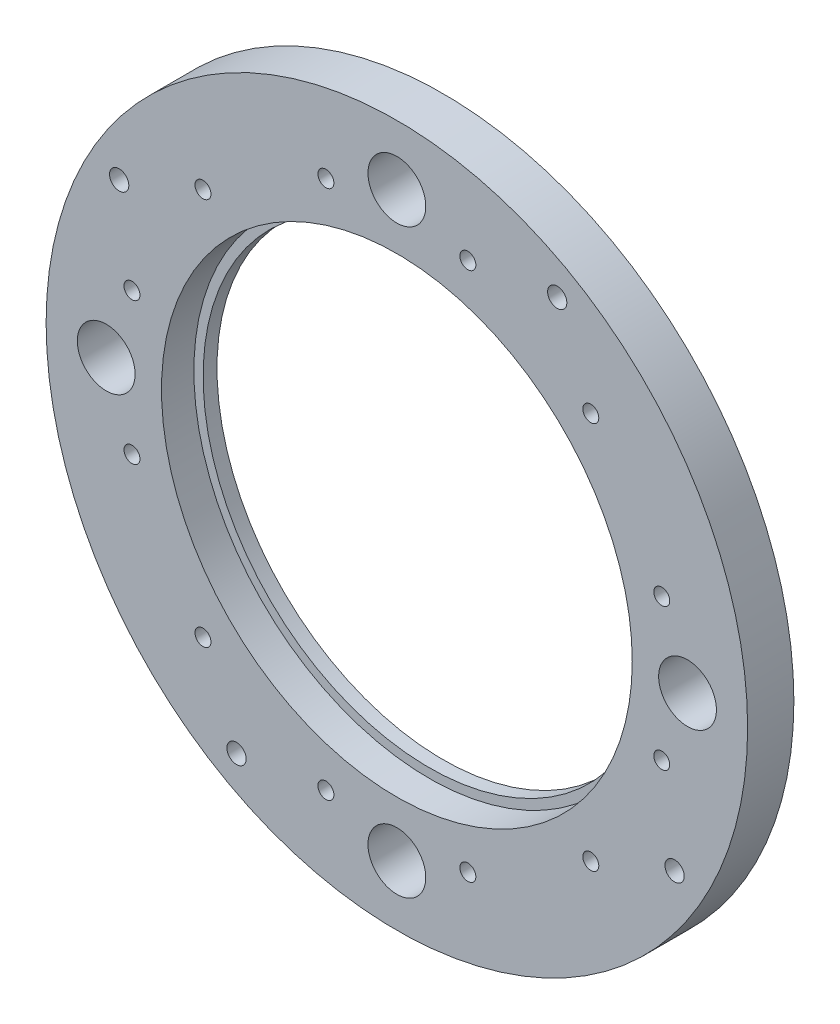
ISO-10303-21;
HEADER;
FILE_DESCRIPTION(('STEP AP214'),'2;1');
FILE_NAME('part.step','',(''),(''),'','','');
FILE_SCHEMA(('AUTOMOTIVE_DESIGN { 1 0 10303 214 1 1 1 1 }'));
ENDSEC;
DATA;
#1=APPLICATION_CONTEXT('core data for automotive mechanical design processes');
#2=APPLICATION_PROTOCOL_DEFINITION('international standard','automotive_design',2000,#1);
#3=PRODUCT_CONTEXT('',#1,'mechanical');
#4=PRODUCT('Part','Part','',(#3));
#5=PRODUCT_RELATED_PRODUCT_CATEGORY('part','',(#4));
#6=PRODUCT_DEFINITION_FORMATION('','',#4);
#7=PRODUCT_DEFINITION_CONTEXT('part definition',#1,'design');
#8=PRODUCT_DEFINITION('design','',#6,#7);
#9=PRODUCT_DEFINITION_SHAPE('','',#8);
#10=(LENGTH_UNIT() NAMED_UNIT(*) SI_UNIT(.MILLI.,.METRE.));
#11=(NAMED_UNIT(*) PLANE_ANGLE_UNIT() SI_UNIT($,.RADIAN.));
#12=(NAMED_UNIT(*) SI_UNIT($,.STERADIAN.) SOLID_ANGLE_UNIT());
#13=UNCERTAINTY_MEASURE_WITH_UNIT(LENGTH_MEASURE(1.E-05),#10,'distance_accuracy_value','');
#14=(GEOMETRIC_REPRESENTATION_CONTEXT(3) GLOBAL_UNCERTAINTY_ASSIGNED_CONTEXT((#13)) GLOBAL_UNIT_ASSIGNED_CONTEXT((#10,
#11,#12)) REPRESENTATION_CONTEXT('',''));
#15=CARTESIAN_POINT('',(0.,0.,0.));
#16=DIRECTION('',(0.,0.,1.));
#17=DIRECTION('',(1.,0.,0.));
#18=AXIS2_PLACEMENT_3D('',#15,#16,#17);
#19=CARTESIAN_POINT('',(0.,0.,5.));
#20=DIRECTION('',(0.,0.,-1.));
#21=DIRECTION('',(-1.,0.,0.));
#22=AXIS2_PLACEMENT_3D('',#19,#20,#21);
#23=CYLINDRICAL_SURFACE('',#22,75.85);
#24=CARTESIAN_POINT('',(0.,0.,5.));
#25=DIRECTION('',(0.,0.,-1.));
#26=DIRECTION('',(-1.,0.,0.));
#27=AXIS2_PLACEMENT_3D('',#24,#25,#26);
#28=CIRCLE('',#27,75.85);
#29=CARTESIAN_POINT('',(-75.85,0.,5.));
#30=VERTEX_POINT('',#29);
#31=EDGE_CURVE('E10',#30,#30,#28,.T.);
#32=ORIENTED_EDGE('',*,*,#31,.T.);
#33=EDGE_LOOP('',(#32));
#34=FACE_BOUND('',#33,.T.);
#35=CARTESIAN_POINT('',(0.,0.,-5.));
#36=DIRECTION('',(0.,0.,-1.));
#37=DIRECTION('',(-1.,0.,0.));
#38=AXIS2_PLACEMENT_3D('',#35,#36,#37);
#39=CIRCLE('',#38,75.85);
#40=CARTESIAN_POINT('',(-75.85,0.,-5.));
#41=VERTEX_POINT('',#40);
#42=EDGE_CURVE('E48',#41,#41,#39,.T.);
#43=ORIENTED_EDGE('',*,*,#42,.F.);
#44=EDGE_LOOP('',(#43));
#45=FACE_BOUND('',#44,.T.);
#46=ADVANCED_FACE('F41',(#34,#45),#23,.T.);
#47=CARTESIAN_POINT('',(75.85,0.,5.));
#48=DIRECTION('',(0.,0.,1.));
#49=DIRECTION('',(1.,0.,0.));
#50=AXIS2_PLACEMENT_3D('',#47,#48,#49);
#51=PLANE('',#50);
#52=CARTESIAN_POINT('',(0.,0.,5.));
#53=DIRECTION('',(0.,0.,1.));
#54=DIRECTION('',(1.,0.,0.));
#55=AXIS2_PLACEMENT_3D('',#52,#53,#54);
#56=CIRCLE('',#55,50.9);
#57=CARTESIAN_POINT('',(50.9,0.,5.));
#58=VERTEX_POINT('',#57);
#59=EDGE_CURVE('E230',#58,#58,#56,.T.);
#60=ORIENTED_EDGE('',*,*,#59,.F.);
#61=EDGE_LOOP('',(#60));
#62=FACE_BOUND('',#61,.T.);
#63=CARTESIAN_POINT('',(-62.85,0.,4.99999999999999));
#64=DIRECTION('',(0.,0.,-1.));
#65=DIRECTION('',(-1.,0.,0.));
#66=AXIS2_PLACEMENT_3D('',#63,#64,#65);
#67=CIRCLE('',#66,6.24999999999998);
#68=CARTESIAN_POINT('',(-69.1,0.,4.99999999999999));
#69=VERTEX_POINT('',#68);
#70=EDGE_CURVE('E210',#69,#69,#67,.T.);
#71=ORIENTED_EDGE('',*,*,#70,.T.);
#72=EDGE_LOOP('',(#71));
#73=FACE_BOUND('',#72,.T.);
#74=CARTESIAN_POINT('',(0.,-62.85,4.99999999999999));
#75=DIRECTION('',(0.,0.,-1.));
#76=DIRECTION('',(-1.,0.,0.));
#77=AXIS2_PLACEMENT_3D('',#74,#75,#76);
#78=CIRCLE('',#77,6.24999999999999);
#79=CARTESIAN_POINT('',(-6.24999999999997,-62.85,4.99999999999999));
#80=VERTEX_POINT('',#79);
#81=EDGE_CURVE('E202',#80,#80,#78,.T.);
#82=ORIENTED_EDGE('',*,*,#81,.T.);
#83=EDGE_LOOP('',(#82));
#84=FACE_BOUND('',#83,.T.);
#85=CARTESIAN_POINT('',(62.85,0.,4.99999999999999));
#86=DIRECTION('',(0.,0.,-1.));
#87=DIRECTION('',(-1.,0.,0.));
#88=AXIS2_PLACEMENT_3D('',#85,#86,#87);
#89=CIRCLE('',#88,6.24999999999999);
#90=CARTESIAN_POINT('',(56.6,0.,4.99999999999999));
#91=VERTEX_POINT('',#90);
#92=EDGE_CURVE('E194',#91,#91,#89,.T.);
#93=ORIENTED_EDGE('',*,*,#92,.T.);
#94=EDGE_LOOP('',(#93));
#95=FACE_BOUND('',#94,.T.);
#96=CARTESIAN_POINT('',(0.,62.85,4.99999999999999));
#97=DIRECTION('',(0.,0.,-1.));
#98=DIRECTION('',(-1.,0.,0.));
#99=AXIS2_PLACEMENT_3D('',#96,#97,#98);
#100=CIRCLE('',#99,6.24999999999999);
#101=CARTESIAN_POINT('',(-6.24999999999998,62.85,4.99999999999999));
#102=VERTEX_POINT('',#101);
#103=EDGE_CURVE('E186',#102,#102,#100,.T.);
#104=ORIENTED_EDGE('',*,*,#103,.T.);
#105=EDGE_LOOP('',(#104));
#106=FACE_BOUND('',#105,.T.);
#107=CARTESIAN_POINT('',(-41.9314321243622,41.9314321243622,4.99999999999999));
#108=DIRECTION('',(0.,0.,-1.));
#109=DIRECTION('',(-1.,0.,0.));
#110=AXIS2_PLACEMENT_3D('',#107,#108,#109);
#111=CIRCLE('',#110,1.72719999999998);
#112=CARTESIAN_POINT('',(-43.6586321243622,41.9314321243622,4.99999999999999));
#113=VERTEX_POINT('',#112);
#114=EDGE_CURVE('E178',#113,#113,#111,.T.);
#115=ORIENTED_EDGE('',*,*,#114,.T.);
#116=EDGE_LOOP('',(#115));
#117=FACE_BOUND('',#116,.T.);
#118=CARTESIAN_POINT('',(-57.2794014989404,15.3479693745799,4.99999999999999));
#119=DIRECTION('',(0.,0.,-1.));
#120=DIRECTION('',(-1.,0.,0.));
#121=AXIS2_PLACEMENT_3D('',#118,#119,#120);
#122=CIRCLE('',#121,1.72719999999998);
#123=CARTESIAN_POINT('',(-59.0066014989404,15.3479693745799,4.99999999999999));
#124=VERTEX_POINT('',#123);
#125=EDGE_CURVE('E170',#124,#124,#122,.T.);
#126=ORIENTED_EDGE('',*,*,#125,.T.);
#127=EDGE_LOOP('',(#126));
#128=FACE_BOUND('',#127,.T.);
#129=CARTESIAN_POINT('',(-57.2794014989394,-15.3479693745781,4.99999999999999));
#130=DIRECTION('',(0.,0.,-1.));
#131=DIRECTION('',(-1.,0.,0.));
#132=AXIS2_PLACEMENT_3D('',#129,#130,#131);
#133=CIRCLE('',#132,1.72719999999998);
#134=CARTESIAN_POINT('',(-59.0066014989394,-15.3479693745781,4.99999999999999));
#135=VERTEX_POINT('',#134);
#136=EDGE_CURVE('E162',#135,#135,#133,.T.);
#137=ORIENTED_EDGE('',*,*,#136,.T.);
#138=EDGE_LOOP('',(#137));
#139=FACE_BOUND('',#138,.T.);
#140=CARTESIAN_POINT('',(-41.9314321243595,-41.9314321243595,4.99999999999999));
#141=DIRECTION('',(0.,0.,-1.));
#142=DIRECTION('',(-1.,0.,0.));
#143=AXIS2_PLACEMENT_3D('',#140,#141,#142);
#144=CIRCLE('',#143,1.72719999999998);
#145=CARTESIAN_POINT('',(-43.6586321243595,-41.9314321243595,4.99999999999999));
#146=VERTEX_POINT('',#145);
#147=EDGE_CURVE('E154',#146,#146,#144,.T.);
#148=ORIENTED_EDGE('',*,*,#147,.T.);
#149=EDGE_LOOP('',(#148));
#150=FACE_BOUND('',#149,.T.);
#151=CARTESIAN_POINT('',(-15.3479693745772,-57.2794014989375,4.99999999999999));
#152=DIRECTION('',(0.,0.,-1.));
#153=DIRECTION('',(-1.,0.,0.));
#154=AXIS2_PLACEMENT_3D('',#151,#152,#153);
#155=CIRCLE('',#154,1.72719999999998);
#156=CARTESIAN_POINT('',(-17.0751693745772,-57.2794014989375,4.99999999999999));
#157=VERTEX_POINT('',#156);
#158=EDGE_CURVE('E146',#157,#157,#155,.T.);
#159=ORIENTED_EDGE('',*,*,#158,.T.);
#160=EDGE_LOOP('',(#159));
#161=FACE_BOUND('',#160,.T.);
#162=CARTESIAN_POINT('',(15.3479693745807,-57.2794014989365,4.99999999999999));
#163=DIRECTION('',(0.,0.,-1.));
#164=DIRECTION('',(-1.,0.,0.));
#165=AXIS2_PLACEMENT_3D('',#162,#163,#164);
#166=CIRCLE('',#165,1.72719999999999);
#167=CARTESIAN_POINT('',(13.6207693745808,-57.2794014989365,4.99999999999999));
#168=VERTEX_POINT('',#167);
#169=EDGE_CURVE('E138',#168,#168,#166,.T.);
#170=ORIENTED_EDGE('',*,*,#169,.T.);
#171=EDGE_LOOP('',(#170));
#172=FACE_BOUND('',#171,.T.);
#173=CARTESIAN_POINT('',(41.9314321243622,-41.9314321243567,4.99999999999999));
#174=DIRECTION('',(0.,0.,-1.));
#175=DIRECTION('',(-1.,0.,0.));
#176=AXIS2_PLACEMENT_3D('',#173,#174,#175);
#177=CIRCLE('',#176,1.72719999999998);
#178=CARTESIAN_POINT('',(40.2042321243622,-41.9314321243567,4.99999999999999));
#179=VERTEX_POINT('',#178);
#180=EDGE_CURVE('E130',#179,#179,#177,.T.);
#181=ORIENTED_EDGE('',*,*,#180,.T.);
#182=EDGE_LOOP('',(#181));
#183=FACE_BOUND('',#182,.T.);
#184=CARTESIAN_POINT('',(57.2794014989402,-15.3479693745744,4.99999999999999));
#185=DIRECTION('',(0.,0.,-1.));
#186=DIRECTION('',(-1.,0.,0.));
#187=AXIS2_PLACEMENT_3D('',#184,#185,#186);
#188=CIRCLE('',#187,1.72719999999998);
#189=CARTESIAN_POINT('',(55.5522014989402,-15.3479693745744,4.99999999999999));
#190=VERTEX_POINT('',#189);
#191=EDGE_CURVE('E122',#190,#190,#188,.T.);
#192=ORIENTED_EDGE('',*,*,#191,.T.);
#193=EDGE_LOOP('',(#192));
#194=FACE_BOUND('',#193,.T.);
#195=CARTESIAN_POINT('',(57.2794014989393,15.3479693745836,4.99999999999999));
#196=DIRECTION('',(0.,0.,-1.));
#197=DIRECTION('',(-1.,0.,0.));
#198=AXIS2_PLACEMENT_3D('',#195,#196,#197);
#199=CIRCLE('',#198,1.72719999999998);
#200=CARTESIAN_POINT('',(55.5522014989393,15.3479693745836,4.99999999999999));
#201=VERTEX_POINT('',#200);
#202=EDGE_CURVE('E114',#201,#201,#199,.T.);
#203=ORIENTED_EDGE('',*,*,#202,.T.);
#204=EDGE_LOOP('',(#203));
#205=FACE_BOUND('',#204,.T.);
#206=CARTESIAN_POINT('',(41.9314321243595,41.931432124365,4.99999999999999));
#207=DIRECTION('',(0.,0.,-1.));
#208=DIRECTION('',(-1.,0.,0.));
#209=AXIS2_PLACEMENT_3D('',#206,#207,#208);
#210=CIRCLE('',#209,1.72719999999998);
#211=CARTESIAN_POINT('',(40.2042321243595,41.931432124365,4.99999999999999));
#212=VERTEX_POINT('',#211);
#213=EDGE_CURVE('E106',#212,#212,#210,.T.);
#214=ORIENTED_EDGE('',*,*,#213,.T.);
#215=EDGE_LOOP('',(#214));
#216=FACE_BOUND('',#215,.T.);
#217=CARTESIAN_POINT('',(15.3479693745771,57.2794014989431,4.99999999999999));
#218=DIRECTION('',(0.,0.,-1.));
#219=DIRECTION('',(-1.,0.,0.));
#220=AXIS2_PLACEMENT_3D('',#217,#218,#219);
#221=CIRCLE('',#220,1.72719999999999);
#222=CARTESIAN_POINT('',(13.6207693745771,57.2794014989431,4.99999999999999));
#223=VERTEX_POINT('',#222);
#224=EDGE_CURVE('E98',#223,#223,#221,.T.);
#225=ORIENTED_EDGE('',*,*,#224,.T.);
#226=EDGE_LOOP('',(#225));
#227=FACE_BOUND('',#226,.T.);
#228=CARTESIAN_POINT('',(-15.3479693745809,57.2794014989421,4.99999999999999));
#229=DIRECTION('',(0.,0.,-1.));
#230=DIRECTION('',(-1.,0.,0.));
#231=AXIS2_PLACEMENT_3D('',#228,#229,#230);
#232=CIRCLE('',#231,1.72719999999998);
#233=CARTESIAN_POINT('',(-17.0751693745809,57.2794014989421,4.99999999999999));
#234=VERTEX_POINT('',#233);
#235=EDGE_CURVE('E90',#234,#234,#232,.T.);
#236=ORIENTED_EDGE('',*,*,#235,.T.);
#237=EDGE_LOOP('',(#236));
#238=FACE_BOUND('',#237,.T.);
#239=CARTESIAN_POINT('',(-60.0519335492206,34.671,4.99999999999999));
#240=DIRECTION('',(0.,0.,-1.));
#241=DIRECTION('',(-1.,0.,0.));
#242=AXIS2_PLACEMENT_3D('',#239,#240,#241);
#243=CIRCLE('',#242,2.08279999999999);
#244=CARTESIAN_POINT('',(-62.1347335492206,34.671,4.99999999999999));
#245=VERTEX_POINT('',#244);
#246=EDGE_CURVE('E82',#245,#245,#243,.T.);
#247=ORIENTED_EDGE('',*,*,#246,.T.);
#248=EDGE_LOOP('',(#247));
#249=FACE_BOUND('',#248,.T.);
#250=CARTESIAN_POINT('',(34.671,60.0519335492206,4.99999999999999));
#251=DIRECTION('',(0.,0.,-1.));
#252=DIRECTION('',(-1.,0.,0.));
#253=AXIS2_PLACEMENT_3D('',#250,#251,#252);
#254=CIRCLE('',#253,2.08279999999999);
#255=CARTESIAN_POINT('',(32.5882,60.0519335492206,4.99999999999999));
#256=VERTEX_POINT('',#255);
#257=EDGE_CURVE('E74',#256,#256,#254,.T.);
#258=ORIENTED_EDGE('',*,*,#257,.T.);
#259=EDGE_LOOP('',(#258));
#260=FACE_BOUND('',#259,.T.);
#261=CARTESIAN_POINT('',(60.0519335492206,-34.671,4.99999999999999));
#262=DIRECTION('',(0.,0.,-1.));
#263=DIRECTION('',(-1.,0.,0.));
#264=AXIS2_PLACEMENT_3D('',#261,#262,#263);
#265=CIRCLE('',#264,2.08279999999999);
#266=CARTESIAN_POINT('',(57.9691335492206,-34.671,4.99999999999999));
#267=VERTEX_POINT('',#266);
#268=EDGE_CURVE('E66',#267,#267,#265,.T.);
#269=ORIENTED_EDGE('',*,*,#268,.T.);
#270=EDGE_LOOP('',(#269));
#271=FACE_BOUND('',#270,.T.);
#272=CARTESIAN_POINT('',(-34.671,-60.0519335492206,4.99999999999999));
#273=DIRECTION('',(0.,0.,-1.));
#274=DIRECTION('',(-1.,0.,0.));
#275=AXIS2_PLACEMENT_3D('',#272,#273,#274);
#276=CIRCLE('',#275,2.08279999999999);
#277=CARTESIAN_POINT('',(-36.7538,-60.0519335492206,4.99999999999999));
#278=VERTEX_POINT('',#277);
#279=EDGE_CURVE('E54',#278,#278,#276,.T.);
#280=ORIENTED_EDGE('',*,*,#279,.T.);
#281=EDGE_LOOP('',(#280));
#282=FACE_BOUND('',#281,.T.);
#283=ORIENTED_EDGE('',*,*,#31,.F.);
#284=EDGE_LOOP('',(#283));
#285=FACE_BOUND('',#284,.T.);
#286=ADVANCED_FACE('F238',(#62,#73,#84,#95,#106,#117,#128,#139,#150,#161,#172,#183,#194,#205,
#216,#227,#238,#249,#260,#271,#282,#285),#51,.T.);
#287=CARTESIAN_POINT('',(0.,0.,-5.));
#288=DIRECTION('',(0.,0.,-1.));
#289=DIRECTION('',(-1.,0.,0.));
#290=AXIS2_PLACEMENT_3D('',#287,#288,#289);
#291=PLANE('',#290);
#292=CARTESIAN_POINT('',(0.,0.,-5.00000000000001));
#293=DIRECTION('',(0.,0.,1.));
#294=DIRECTION('',(1.,0.,0.));
#295=AXIS2_PLACEMENT_3D('',#292,#293,#294);
#296=CIRCLE('',#295,48.9);
#297=CARTESIAN_POINT('',(48.9,0.,-5.00000000000001));
#298=VERTEX_POINT('',#297);
#299=EDGE_CURVE('E218',#298,#298,#296,.T.);
#300=ORIENTED_EDGE('',*,*,#299,.T.);
#301=EDGE_LOOP('',(#300));
#302=FACE_BOUND('',#301,.T.);
#303=CARTESIAN_POINT('',(-62.85,0.,-5.));
#304=DIRECTION('',(0.,0.,-1.));
#305=DIRECTION('',(-1.,0.,0.));
#306=AXIS2_PLACEMENT_3D('',#303,#304,#305);
#307=CIRCLE('',#306,6.24999999999998);
#308=CARTESIAN_POINT('',(-69.1,0.,-5.));
#309=VERTEX_POINT('',#308);
#310=EDGE_CURVE('E214',#309,#309,#307,.T.);
#311=ORIENTED_EDGE('',*,*,#310,.F.);
#312=EDGE_LOOP('',(#311));
#313=FACE_BOUND('',#312,.T.);
#314=CARTESIAN_POINT('',(0.,-62.85,-5.));
#315=DIRECTION('',(0.,0.,-1.));
#316=DIRECTION('',(-1.,0.,0.));
#317=AXIS2_PLACEMENT_3D('',#314,#315,#316);
#318=CIRCLE('',#317,6.24999999999999);
#319=CARTESIAN_POINT('',(-6.24999999999997,-62.85,-5.));
#320=VERTEX_POINT('',#319);
#321=EDGE_CURVE('E206',#320,#320,#318,.T.);
#322=ORIENTED_EDGE('',*,*,#321,.F.);
#323=EDGE_LOOP('',(#322));
#324=FACE_BOUND('',#323,.T.);
#325=CARTESIAN_POINT('',(62.85,0.,-5.));
#326=DIRECTION('',(0.,0.,-1.));
#327=DIRECTION('',(-1.,0.,0.));
#328=AXIS2_PLACEMENT_3D('',#325,#326,#327);
#329=CIRCLE('',#328,6.24999999999999);
#330=CARTESIAN_POINT('',(56.6,0.,-5.));
#331=VERTEX_POINT('',#330);
#332=EDGE_CURVE('E198',#331,#331,#329,.T.);
#333=ORIENTED_EDGE('',*,*,#332,.F.);
#334=EDGE_LOOP('',(#333));
#335=FACE_BOUND('',#334,.T.);
#336=CARTESIAN_POINT('',(0.,62.85,-5.));
#337=DIRECTION('',(0.,0.,-1.));
#338=DIRECTION('',(-1.,0.,0.));
#339=AXIS2_PLACEMENT_3D('',#336,#337,#338);
#340=CIRCLE('',#339,6.24999999999999);
#341=CARTESIAN_POINT('',(-6.24999999999998,62.85,-5.));
#342=VERTEX_POINT('',#341);
#343=EDGE_CURVE('E190',#342,#342,#340,.T.);
#344=ORIENTED_EDGE('',*,*,#343,.F.);
#345=EDGE_LOOP('',(#344));
#346=FACE_BOUND('',#345,.T.);
#347=CARTESIAN_POINT('',(-41.9314321243622,41.9314321243622,-5.));
#348=DIRECTION('',(0.,0.,-1.));
#349=DIRECTION('',(-1.,0.,0.));
#350=AXIS2_PLACEMENT_3D('',#347,#348,#349);
#351=CIRCLE('',#350,1.72719999999998);
#352=CARTESIAN_POINT('',(-43.6586321243622,41.9314321243622,-5.));
#353=VERTEX_POINT('',#352);
#354=EDGE_CURVE('E182',#353,#353,#351,.T.);
#355=ORIENTED_EDGE('',*,*,#354,.F.);
#356=EDGE_LOOP('',(#355));
#357=FACE_BOUND('',#356,.T.);
#358=CARTESIAN_POINT('',(-57.2794014989404,15.3479693745799,-5.));
#359=DIRECTION('',(0.,0.,-1.));
#360=DIRECTION('',(-1.,0.,0.));
#361=AXIS2_PLACEMENT_3D('',#358,#359,#360);
#362=CIRCLE('',#361,1.72719999999998);
#363=CARTESIAN_POINT('',(-59.0066014989404,15.3479693745799,-5.));
#364=VERTEX_POINT('',#363);
#365=EDGE_CURVE('E174',#364,#364,#362,.T.);
#366=ORIENTED_EDGE('',*,*,#365,.F.);
#367=EDGE_LOOP('',(#366));
#368=FACE_BOUND('',#367,.T.);
#369=CARTESIAN_POINT('',(-57.2794014989394,-15.3479693745781,-5.));
#370=DIRECTION('',(0.,0.,-1.));
#371=DIRECTION('',(-1.,0.,0.));
#372=AXIS2_PLACEMENT_3D('',#369,#370,#371);
#373=CIRCLE('',#372,1.72719999999998);
#374=CARTESIAN_POINT('',(-59.0066014989394,-15.3479693745781,-5.));
#375=VERTEX_POINT('',#374);
#376=EDGE_CURVE('E166',#375,#375,#373,.T.);
#377=ORIENTED_EDGE('',*,*,#376,.F.);
#378=EDGE_LOOP('',(#377));
#379=FACE_BOUND('',#378,.T.);
#380=CARTESIAN_POINT('',(-41.9314321243595,-41.9314321243595,-5.));
#381=DIRECTION('',(0.,0.,-1.));
#382=DIRECTION('',(-1.,0.,0.));
#383=AXIS2_PLACEMENT_3D('',#380,#381,#382);
#384=CIRCLE('',#383,1.72719999999998);
#385=CARTESIAN_POINT('',(-43.6586321243595,-41.9314321243595,-5.));
#386=VERTEX_POINT('',#385);
#387=EDGE_CURVE('E158',#386,#386,#384,.T.);
#388=ORIENTED_EDGE('',*,*,#387,.F.);
#389=EDGE_LOOP('',(#388));
#390=FACE_BOUND('',#389,.T.);
#391=CARTESIAN_POINT('',(-15.3479693745772,-57.2794014989375,-5.));
#392=DIRECTION('',(0.,0.,-1.));
#393=DIRECTION('',(-1.,0.,0.));
#394=AXIS2_PLACEMENT_3D('',#391,#392,#393);
#395=CIRCLE('',#394,1.72719999999999);
#396=CARTESIAN_POINT('',(-17.0751693745772,-57.2794014989375,-5.));
#397=VERTEX_POINT('',#396);
#398=EDGE_CURVE('E150',#397,#397,#395,.T.);
#399=ORIENTED_EDGE('',*,*,#398,.F.);
#400=EDGE_LOOP('',(#399));
#401=FACE_BOUND('',#400,.T.);
#402=CARTESIAN_POINT('',(15.3479693745807,-57.2794014989365,-5.));
#403=DIRECTION('',(0.,0.,-1.));
#404=DIRECTION('',(-1.,0.,0.));
#405=AXIS2_PLACEMENT_3D('',#402,#403,#404);
#406=CIRCLE('',#405,1.72719999999999);
#407=CARTESIAN_POINT('',(13.6207693745808,-57.2794014989365,-5.));
#408=VERTEX_POINT('',#407);
#409=EDGE_CURVE('E142',#408,#408,#406,.T.);
#410=ORIENTED_EDGE('',*,*,#409,.F.);
#411=EDGE_LOOP('',(#410));
#412=FACE_BOUND('',#411,.T.);
#413=CARTESIAN_POINT('',(41.9314321243622,-41.9314321243567,-5.));
#414=DIRECTION('',(0.,0.,-1.));
#415=DIRECTION('',(-1.,0.,0.));
#416=AXIS2_PLACEMENT_3D('',#413,#414,#415);
#417=CIRCLE('',#416,1.72719999999998);
#418=CARTESIAN_POINT('',(40.2042321243622,-41.9314321243567,-5.));
#419=VERTEX_POINT('',#418);
#420=EDGE_CURVE('E134',#419,#419,#417,.T.);
#421=ORIENTED_EDGE('',*,*,#420,.F.);
#422=EDGE_LOOP('',(#421));
#423=FACE_BOUND('',#422,.T.);
#424=CARTESIAN_POINT('',(57.2794014989402,-15.3479693745744,-5.));
#425=DIRECTION('',(0.,0.,-1.));
#426=DIRECTION('',(-1.,0.,0.));
#427=AXIS2_PLACEMENT_3D('',#424,#425,#426);
#428=CIRCLE('',#427,1.72719999999998);
#429=CARTESIAN_POINT('',(55.5522014989402,-15.3479693745744,-5.));
#430=VERTEX_POINT('',#429);
#431=EDGE_CURVE('E126',#430,#430,#428,.T.);
#432=ORIENTED_EDGE('',*,*,#431,.F.);
#433=EDGE_LOOP('',(#432));
#434=FACE_BOUND('',#433,.T.);
#435=CARTESIAN_POINT('',(57.2794014989393,15.3479693745836,-5.));
#436=DIRECTION('',(0.,0.,-1.));
#437=DIRECTION('',(-1.,0.,0.));
#438=AXIS2_PLACEMENT_3D('',#435,#436,#437);
#439=CIRCLE('',#438,1.72719999999998);
#440=CARTESIAN_POINT('',(55.5522014989393,15.3479693745836,-5.));
#441=VERTEX_POINT('',#440);
#442=EDGE_CURVE('E118',#441,#441,#439,.T.);
#443=ORIENTED_EDGE('',*,*,#442,.F.);
#444=EDGE_LOOP('',(#443));
#445=FACE_BOUND('',#444,.T.);
#446=CARTESIAN_POINT('',(41.9314321243595,41.931432124365,-5.));
#447=DIRECTION('',(0.,0.,-1.));
#448=DIRECTION('',(-1.,0.,0.));
#449=AXIS2_PLACEMENT_3D('',#446,#447,#448);
#450=CIRCLE('',#449,1.72719999999998);
#451=CARTESIAN_POINT('',(40.2042321243595,41.931432124365,-5.));
#452=VERTEX_POINT('',#451);
#453=EDGE_CURVE('E110',#452,#452,#450,.T.);
#454=ORIENTED_EDGE('',*,*,#453,.F.);
#455=EDGE_LOOP('',(#454));
#456=FACE_BOUND('',#455,.T.);
#457=CARTESIAN_POINT('',(15.3479693745771,57.2794014989431,-5.));
#458=DIRECTION('',(0.,0.,-1.));
#459=DIRECTION('',(-1.,0.,0.));
#460=AXIS2_PLACEMENT_3D('',#457,#458,#459);
#461=CIRCLE('',#460,1.72719999999999);
#462=CARTESIAN_POINT('',(13.6207693745771,57.2794014989431,-5.));
#463=VERTEX_POINT('',#462);
#464=EDGE_CURVE('E102',#463,#463,#461,.T.);
#465=ORIENTED_EDGE('',*,*,#464,.F.);
#466=EDGE_LOOP('',(#465));
#467=FACE_BOUND('',#466,.T.);
#468=CARTESIAN_POINT('',(-15.3479693745809,57.2794014989421,-5.));
#469=DIRECTION('',(0.,0.,-1.));
#470=DIRECTION('',(-1.,0.,0.));
#471=AXIS2_PLACEMENT_3D('',#468,#469,#470);
#472=CIRCLE('',#471,1.72719999999999);
#473=CARTESIAN_POINT('',(-17.0751693745809,57.2794014989421,-5.));
#474=VERTEX_POINT('',#473);
#475=EDGE_CURVE('E94',#474,#474,#472,.T.);
#476=ORIENTED_EDGE('',*,*,#475,.F.);
#477=EDGE_LOOP('',(#476));
#478=FACE_BOUND('',#477,.T.);
#479=CARTESIAN_POINT('',(-60.0519335492206,34.671,-5.));
#480=DIRECTION('',(0.,0.,-1.));
#481=DIRECTION('',(-1.,0.,0.));
#482=AXIS2_PLACEMENT_3D('',#479,#480,#481);
#483=CIRCLE('',#482,2.08279999999999);
#484=CARTESIAN_POINT('',(-62.1347335492206,34.671,-5.));
#485=VERTEX_POINT('',#484);
#486=EDGE_CURVE('E86',#485,#485,#483,.T.);
#487=ORIENTED_EDGE('',*,*,#486,.F.);
#488=EDGE_LOOP('',(#487));
#489=FACE_BOUND('',#488,.T.);
#490=CARTESIAN_POINT('',(34.671,60.0519335492206,-5.));
#491=DIRECTION('',(0.,0.,-1.));
#492=DIRECTION('',(-1.,0.,0.));
#493=AXIS2_PLACEMENT_3D('',#490,#491,#492);
#494=CIRCLE('',#493,2.08279999999999);
#495=CARTESIAN_POINT('',(32.5882,60.0519335492206,-5.));
#496=VERTEX_POINT('',#495);
#497=EDGE_CURVE('E78',#496,#496,#494,.T.);
#498=ORIENTED_EDGE('',*,*,#497,.F.);
#499=EDGE_LOOP('',(#498));
#500=FACE_BOUND('',#499,.T.);
#501=CARTESIAN_POINT('',(60.0519335492206,-34.671,-5.));
#502=DIRECTION('',(0.,0.,-1.));
#503=DIRECTION('',(-1.,0.,0.));
#504=AXIS2_PLACEMENT_3D('',#501,#502,#503);
#505=CIRCLE('',#504,2.08279999999999);
#506=CARTESIAN_POINT('',(57.9691335492206,-34.671,-5.));
#507=VERTEX_POINT('',#506);
#508=EDGE_CURVE('E70',#507,#507,#505,.T.);
#509=ORIENTED_EDGE('',*,*,#508,.F.);
#510=EDGE_LOOP('',(#509));
#511=FACE_BOUND('',#510,.T.);
#512=CARTESIAN_POINT('',(-34.671,-60.0519335492206,-5.));
#513=DIRECTION('',(0.,0.,-1.));
#514=DIRECTION('',(-1.,0.,0.));
#515=AXIS2_PLACEMENT_3D('',#512,#513,#514);
#516=CIRCLE('',#515,2.08279999999999);
#517=CARTESIAN_POINT('',(-36.7538,-60.0519335492206,-5.));
#518=VERTEX_POINT('',#517);
#519=EDGE_CURVE('E60',#518,#518,#516,.T.);
#520=ORIENTED_EDGE('',*,*,#519,.F.);
#521=EDGE_LOOP('',(#520));
#522=FACE_BOUND('',#521,.T.);
#523=ORIENTED_EDGE('',*,*,#42,.T.);
#524=EDGE_LOOP('',(#523));
#525=FACE_BOUND('',#524,.T.);
#526=ADVANCED_FACE('F241',(#302,#313,#324,#335,#346,#357,#368,#379,#390,#401,#412,#423,#434,
#445,#456,#467,#478,#489,#500,#511,#522,#525),#291,.T.);
#527=CARTESIAN_POINT('',(-34.671,-60.0519335492206,-5.));
#528=DIRECTION('',(0.,0.,-1.));
#529=DIRECTION('',(-1.,0.,0.));
#530=AXIS2_PLACEMENT_3D('',#527,#528,#529);
#531=CYLINDRICAL_SURFACE('',#530,2.08279999999999);
#532=ORIENTED_EDGE('',*,*,#279,.F.);
#533=EDGE_LOOP('',(#532));
#534=FACE_BOUND('',#533,.T.);
#535=ORIENTED_EDGE('',*,*,#519,.T.);
#536=EDGE_LOOP('',(#535));
#537=FACE_BOUND('',#536,.T.);
#538=ADVANCED_FACE('F283',(#534,#537),#531,.F.);
#539=CARTESIAN_POINT('',(60.0519335492206,-34.671,-5.));
#540=DIRECTION('',(0.,0.,-1.));
#541=DIRECTION('',(-1.,0.,0.));
#542=AXIS2_PLACEMENT_3D('',#539,#540,#541);
#543=CYLINDRICAL_SURFACE('',#542,2.08279999999999);
#544=ORIENTED_EDGE('',*,*,#268,.F.);
#545=EDGE_LOOP('',(#544));
#546=FACE_BOUND('',#545,.T.);
#547=ORIENTED_EDGE('',*,*,#508,.T.);
#548=EDGE_LOOP('',(#547));
#549=FACE_BOUND('',#548,.T.);
#550=ADVANCED_FACE('F286',(#546,#549),#543,.F.);
#551=CARTESIAN_POINT('',(34.671,60.0519335492206,-5.));
#552=DIRECTION('',(0.,0.,-1.));
#553=DIRECTION('',(-1.,0.,0.));
#554=AXIS2_PLACEMENT_3D('',#551,#552,#553);
#555=CYLINDRICAL_SURFACE('',#554,2.08279999999999);
#556=ORIENTED_EDGE('',*,*,#257,.F.);
#557=EDGE_LOOP('',(#556));
#558=FACE_BOUND('',#557,.T.);
#559=ORIENTED_EDGE('',*,*,#497,.T.);
#560=EDGE_LOOP('',(#559));
#561=FACE_BOUND('',#560,.T.);
#562=ADVANCED_FACE('F314',(#558,#561),#555,.F.);
#563=CARTESIAN_POINT('',(-60.0519335492206,34.671,-5.));
#564=DIRECTION('',(0.,0.,-1.));
#565=DIRECTION('',(-1.,0.,0.));
#566=AXIS2_PLACEMENT_3D('',#563,#564,#565);
#567=CYLINDRICAL_SURFACE('',#566,2.08279999999999);
#568=ORIENTED_EDGE('',*,*,#246,.F.);
#569=EDGE_LOOP('',(#568));
#570=FACE_BOUND('',#569,.T.);
#571=ORIENTED_EDGE('',*,*,#486,.T.);
#572=EDGE_LOOP('',(#571));
#573=FACE_BOUND('',#572,.T.);
#574=ADVANCED_FACE('F323',(#570,#573),#567,.F.);
#575=CARTESIAN_POINT('',(-15.3479693745809,57.2794014989421,-5.));
#576=DIRECTION('',(0.,0.,-1.));
#577=DIRECTION('',(-1.,0.,0.));
#578=AXIS2_PLACEMENT_3D('',#575,#576,#577);
#579=CYLINDRICAL_SURFACE('',#578,1.72719999999999);
#580=ORIENTED_EDGE('',*,*,#235,.F.);
#581=EDGE_LOOP('',(#580));
#582=FACE_BOUND('',#581,.T.);
#583=ORIENTED_EDGE('',*,*,#475,.T.);
#584=EDGE_LOOP('',(#583));
#585=FACE_BOUND('',#584,.T.);
#586=ADVANCED_FACE('F332',(#582,#585),#579,.F.);
#587=CARTESIAN_POINT('',(15.3479693745771,57.2794014989431,-5.));
#588=DIRECTION('',(0.,0.,-1.));
#589=DIRECTION('',(-1.,0.,0.));
#590=AXIS2_PLACEMENT_3D('',#587,#588,#589);
#591=CYLINDRICAL_SURFACE('',#590,1.72719999999999);
#592=ORIENTED_EDGE('',*,*,#224,.F.);
#593=EDGE_LOOP('',(#592));
#594=FACE_BOUND('',#593,.T.);
#595=ORIENTED_EDGE('',*,*,#464,.T.);
#596=EDGE_LOOP('',(#595));
#597=FACE_BOUND('',#596,.T.);
#598=ADVANCED_FACE('F341',(#594,#597),#591,.F.);
#599=CARTESIAN_POINT('',(41.9314321243595,41.931432124365,-5.));
#600=DIRECTION('',(0.,0.,-1.));
#601=DIRECTION('',(-1.,0.,0.));
#602=AXIS2_PLACEMENT_3D('',#599,#600,#601);
#603=CYLINDRICAL_SURFACE('',#602,1.72719999999998);
#604=ORIENTED_EDGE('',*,*,#213,.F.);
#605=EDGE_LOOP('',(#604));
#606=FACE_BOUND('',#605,.T.);
#607=ORIENTED_EDGE('',*,*,#453,.T.);
#608=EDGE_LOOP('',(#607));
#609=FACE_BOUND('',#608,.T.);
#610=ADVANCED_FACE('F350',(#606,#609),#603,.F.);
#611=CARTESIAN_POINT('',(57.2794014989393,15.3479693745836,-5.));
#612=DIRECTION('',(0.,0.,-1.));
#613=DIRECTION('',(-1.,0.,0.));
#614=AXIS2_PLACEMENT_3D('',#611,#612,#613);
#615=CYLINDRICAL_SURFACE('',#614,1.72719999999998);
#616=ORIENTED_EDGE('',*,*,#202,.F.);
#617=EDGE_LOOP('',(#616));
#618=FACE_BOUND('',#617,.T.);
#619=ORIENTED_EDGE('',*,*,#442,.T.);
#620=EDGE_LOOP('',(#619));
#621=FACE_BOUND('',#620,.T.);
#622=ADVANCED_FACE('F359',(#618,#621),#615,.F.);
#623=CARTESIAN_POINT('',(57.2794014989402,-15.3479693745744,-5.));
#624=DIRECTION('',(0.,0.,-1.));
#625=DIRECTION('',(-1.,0.,0.));
#626=AXIS2_PLACEMENT_3D('',#623,#624,#625);
#627=CYLINDRICAL_SURFACE('',#626,1.72719999999998);
#628=ORIENTED_EDGE('',*,*,#191,.F.);
#629=EDGE_LOOP('',(#628));
#630=FACE_BOUND('',#629,.T.);
#631=ORIENTED_EDGE('',*,*,#431,.T.);
#632=EDGE_LOOP('',(#631));
#633=FACE_BOUND('',#632,.T.);
#634=ADVANCED_FACE('F368',(#630,#633),#627,.F.);
#635=CARTESIAN_POINT('',(41.9314321243622,-41.9314321243567,-5.));
#636=DIRECTION('',(0.,0.,-1.));
#637=DIRECTION('',(-1.,0.,0.));
#638=AXIS2_PLACEMENT_3D('',#635,#636,#637);
#639=CYLINDRICAL_SURFACE('',#638,1.72719999999998);
#640=ORIENTED_EDGE('',*,*,#180,.F.);
#641=EDGE_LOOP('',(#640));
#642=FACE_BOUND('',#641,.T.);
#643=ORIENTED_EDGE('',*,*,#420,.T.);
#644=EDGE_LOOP('',(#643));
#645=FACE_BOUND('',#644,.T.);
#646=ADVANCED_FACE('F377',(#642,#645),#639,.F.);
#647=CARTESIAN_POINT('',(15.3479693745807,-57.2794014989365,-5.));
#648=DIRECTION('',(0.,0.,-1.));
#649=DIRECTION('',(-1.,0.,0.));
#650=AXIS2_PLACEMENT_3D('',#647,#648,#649);
#651=CYLINDRICAL_SURFACE('',#650,1.72719999999999);
#652=ORIENTED_EDGE('',*,*,#169,.F.);
#653=EDGE_LOOP('',(#652));
#654=FACE_BOUND('',#653,.T.);
#655=ORIENTED_EDGE('',*,*,#409,.T.);
#656=EDGE_LOOP('',(#655));
#657=FACE_BOUND('',#656,.T.);
#658=ADVANCED_FACE('F386',(#654,#657),#651,.F.);
#659=CARTESIAN_POINT('',(-15.3479693745772,-57.2794014989375,-5.));
#660=DIRECTION('',(0.,0.,-1.));
#661=DIRECTION('',(-1.,0.,0.));
#662=AXIS2_PLACEMENT_3D('',#659,#660,#661);
#663=CYLINDRICAL_SURFACE('',#662,1.72719999999999);
#664=ORIENTED_EDGE('',*,*,#158,.F.);
#665=EDGE_LOOP('',(#664));
#666=FACE_BOUND('',#665,.T.);
#667=ORIENTED_EDGE('',*,*,#398,.T.);
#668=EDGE_LOOP('',(#667));
#669=FACE_BOUND('',#668,.T.);
#670=ADVANCED_FACE('F395',(#666,#669),#663,.F.);
#671=CARTESIAN_POINT('',(-41.9314321243595,-41.9314321243595,-5.));
#672=DIRECTION('',(0.,0.,-1.));
#673=DIRECTION('',(-1.,0.,0.));
#674=AXIS2_PLACEMENT_3D('',#671,#672,#673);
#675=CYLINDRICAL_SURFACE('',#674,1.72719999999998);
#676=ORIENTED_EDGE('',*,*,#147,.F.);
#677=EDGE_LOOP('',(#676));
#678=FACE_BOUND('',#677,.T.);
#679=ORIENTED_EDGE('',*,*,#387,.T.);
#680=EDGE_LOOP('',(#679));
#681=FACE_BOUND('',#680,.T.);
#682=ADVANCED_FACE('F404',(#678,#681),#675,.F.);
#683=CARTESIAN_POINT('',(-57.2794014989394,-15.3479693745781,-5.));
#684=DIRECTION('',(0.,0.,-1.));
#685=DIRECTION('',(-1.,0.,0.));
#686=AXIS2_PLACEMENT_3D('',#683,#684,#685);
#687=CYLINDRICAL_SURFACE('',#686,1.72719999999998);
#688=ORIENTED_EDGE('',*,*,#136,.F.);
#689=EDGE_LOOP('',(#688));
#690=FACE_BOUND('',#689,.T.);
#691=ORIENTED_EDGE('',*,*,#376,.T.);
#692=EDGE_LOOP('',(#691));
#693=FACE_BOUND('',#692,.T.);
#694=ADVANCED_FACE('F413',(#690,#693),#687,.F.);
#695=CARTESIAN_POINT('',(-57.2794014989404,15.3479693745799,-5.));
#696=DIRECTION('',(0.,0.,-1.));
#697=DIRECTION('',(-1.,0.,0.));
#698=AXIS2_PLACEMENT_3D('',#695,#696,#697);
#699=CYLINDRICAL_SURFACE('',#698,1.72719999999998);
#700=ORIENTED_EDGE('',*,*,#125,.F.);
#701=EDGE_LOOP('',(#700));
#702=FACE_BOUND('',#701,.T.);
#703=ORIENTED_EDGE('',*,*,#365,.T.);
#704=EDGE_LOOP('',(#703));
#705=FACE_BOUND('',#704,.T.);
#706=ADVANCED_FACE('F422',(#702,#705),#699,.F.);
#707=CARTESIAN_POINT('',(-41.9314321243622,41.9314321243622,-5.));
#708=DIRECTION('',(0.,0.,-1.));
#709=DIRECTION('',(-1.,0.,0.));
#710=AXIS2_PLACEMENT_3D('',#707,#708,#709);
#711=CYLINDRICAL_SURFACE('',#710,1.72719999999998);
#712=ORIENTED_EDGE('',*,*,#114,.F.);
#713=EDGE_LOOP('',(#712));
#714=FACE_BOUND('',#713,.T.);
#715=ORIENTED_EDGE('',*,*,#354,.T.);
#716=EDGE_LOOP('',(#715));
#717=FACE_BOUND('',#716,.T.);
#718=ADVANCED_FACE('F431',(#714,#717),#711,.F.);
#719=CARTESIAN_POINT('',(0.,62.85,-5.));
#720=DIRECTION('',(0.,0.,-1.));
#721=DIRECTION('',(-1.,0.,0.));
#722=AXIS2_PLACEMENT_3D('',#719,#720,#721);
#723=CYLINDRICAL_SURFACE('',#722,6.24999999999999);
#724=ORIENTED_EDGE('',*,*,#103,.F.);
#725=EDGE_LOOP('',(#724));
#726=FACE_BOUND('',#725,.T.);
#727=ORIENTED_EDGE('',*,*,#343,.T.);
#728=EDGE_LOOP('',(#727));
#729=FACE_BOUND('',#728,.T.);
#730=ADVANCED_FACE('F440',(#726,#729),#723,.F.);
#731=CARTESIAN_POINT('',(62.85,0.,-5.));
#732=DIRECTION('',(0.,0.,-1.));
#733=DIRECTION('',(-1.,0.,0.));
#734=AXIS2_PLACEMENT_3D('',#731,#732,#733);
#735=CYLINDRICAL_SURFACE('',#734,6.24999999999999);
#736=ORIENTED_EDGE('',*,*,#92,.F.);
#737=EDGE_LOOP('',(#736));
#738=FACE_BOUND('',#737,.T.);
#739=ORIENTED_EDGE('',*,*,#332,.T.);
#740=EDGE_LOOP('',(#739));
#741=FACE_BOUND('',#740,.T.);
#742=ADVANCED_FACE('F449',(#738,#741),#735,.F.);
#743=CARTESIAN_POINT('',(0.,-62.85,-5.));
#744=DIRECTION('',(0.,0.,-1.));
#745=DIRECTION('',(-1.,0.,0.));
#746=AXIS2_PLACEMENT_3D('',#743,#744,#745);
#747=CYLINDRICAL_SURFACE('',#746,6.24999999999999);
#748=ORIENTED_EDGE('',*,*,#81,.F.);
#749=EDGE_LOOP('',(#748));
#750=FACE_BOUND('',#749,.T.);
#751=ORIENTED_EDGE('',*,*,#321,.T.);
#752=EDGE_LOOP('',(#751));
#753=FACE_BOUND('',#752,.T.);
#754=ADVANCED_FACE('F458',(#750,#753),#747,.F.);
#755=CARTESIAN_POINT('',(-62.85,0.,-5.));
#756=DIRECTION('',(0.,0.,-1.));
#757=DIRECTION('',(-1.,0.,0.));
#758=AXIS2_PLACEMENT_3D('',#755,#756,#757);
#759=CYLINDRICAL_SURFACE('',#758,6.24999999999998);
#760=ORIENTED_EDGE('',*,*,#70,.F.);
#761=EDGE_LOOP('',(#760));
#762=FACE_BOUND('',#761,.T.);
#763=ORIENTED_EDGE('',*,*,#310,.T.);
#764=EDGE_LOOP('',(#763));
#765=FACE_BOUND('',#764,.T.);
#766=ADVANCED_FACE('F467',(#762,#765),#759,.F.);
#767=CARTESIAN_POINT('',(0.,0.,5.));
#768=DIRECTION('',(0.,0.,1.));
#769=DIRECTION('',(1.,0.,0.));
#770=AXIS2_PLACEMENT_3D('',#767,#768,#769);
#771=CYLINDRICAL_SURFACE('',#770,48.9);
#772=ORIENTED_EDGE('',*,*,#299,.F.);
#773=EDGE_LOOP('',(#772));
#774=FACE_BOUND('',#773,.T.);
#775=CARTESIAN_POINT('',(0.,0.,-2.));
#776=DIRECTION('',(0.,0.,1.));
#777=DIRECTION('',(1.,0.,0.));
#778=AXIS2_PLACEMENT_3D('',#775,#776,#777);
#779=CIRCLE('',#778,48.9);
#780=CARTESIAN_POINT('',(48.9,0.,-2.));
#781=VERTEX_POINT('',#780);
#782=EDGE_CURVE('E222',#781,#781,#779,.T.);
#783=ORIENTED_EDGE('',*,*,#782,.T.);
#784=EDGE_LOOP('',(#783));
#785=FACE_BOUND('',#784,.T.);
#786=ADVANCED_FACE('F475',(#774,#785),#771,.F.);
#787=CARTESIAN_POINT('',(48.9,0.,-2.));
#788=DIRECTION('',(0.,0.,-1.));
#789=DIRECTION('',(-1.,0.,0.));
#790=AXIS2_PLACEMENT_3D('',#787,#788,#789);
#791=PLANE('',#790);
#792=ORIENTED_EDGE('',*,*,#782,.F.);
#793=EDGE_LOOP('',(#792));
#794=FACE_BOUND('',#793,.T.);
#795=CARTESIAN_POINT('',(0.,0.,-2.));
#796=DIRECTION('',(0.,0.,1.));
#797=DIRECTION('',(1.,0.,0.));
#798=AXIS2_PLACEMENT_3D('',#795,#796,#797);
#799=CIRCLE('',#798,50.9);
#800=CARTESIAN_POINT('',(50.9,0.,-2.));
#801=VERTEX_POINT('',#800);
#802=EDGE_CURVE('E226',#801,#801,#799,.T.);
#803=ORIENTED_EDGE('',*,*,#802,.T.);
#804=EDGE_LOOP('',(#803));
#805=FACE_BOUND('',#804,.T.);
#806=ADVANCED_FACE('F514',(#794,#805),#791,.F.);
#807=CARTESIAN_POINT('',(0.,0.,5.));
#808=DIRECTION('',(0.,0.,1.));
#809=DIRECTION('',(1.,0.,0.));
#810=AXIS2_PLACEMENT_3D('',#807,#808,#809);
#811=CYLINDRICAL_SURFACE('',#810,50.9);
#812=ORIENTED_EDGE('',*,*,#802,.F.);
#813=EDGE_LOOP('',(#812));
#814=FACE_BOUND('',#813,.T.);
#815=ORIENTED_EDGE('',*,*,#59,.T.);
#816=EDGE_LOOP('',(#815));
#817=FACE_BOUND('',#816,.T.);
#818=ADVANCED_FACE('F236',(#814,#817),#811,.F.);
#819=CLOSED_SHELL('',(#46,#286,#526,#538,#550,#562,#574,#586,#598,#610,#622,#634,#646,#658,#670,
#682,#694,#706,#718,#730,#742,#754,#766,#786,#806,#818));
#820=MANIFOLD_SOLID_BREP('B2',#819);
#821=ADVANCED_BREP_SHAPE_REPRESENTATION('',(#18,#820),#14);
#822=SHAPE_DEFINITION_REPRESENTATION(#9,#821);
ENDSEC;
END-ISO-10303-21;
